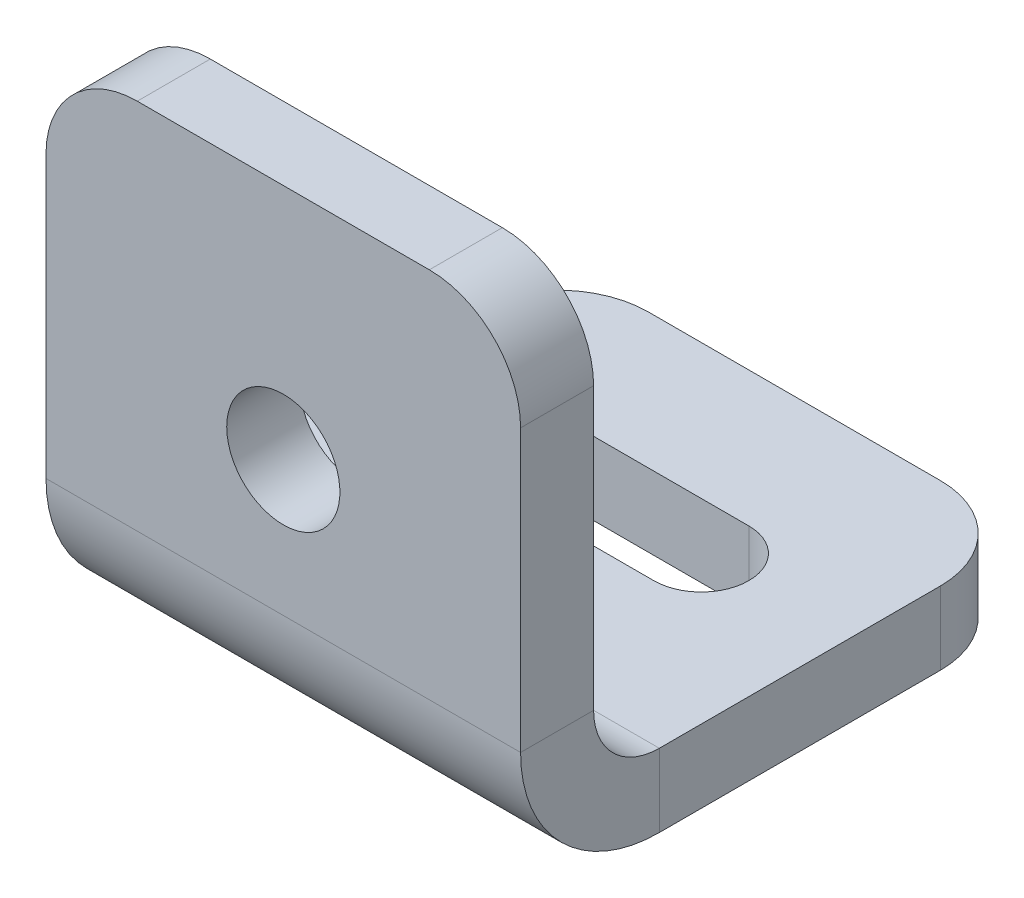
ISO-10303-21;
HEADER;
FILE_DESCRIPTION(('STEP AP214'),'2;1');
FILE_NAME('part.step','',(''),(''),'','','');
FILE_SCHEMA(('AUTOMOTIVE_DESIGN { 1 0 10303 214 1 1 1 1 }'));
ENDSEC;
DATA;
#1=APPLICATION_CONTEXT('core data for automotive mechanical design processes');
#2=APPLICATION_PROTOCOL_DEFINITION('international standard','automotive_design',2000,#1);
#3=PRODUCT_CONTEXT('',#1,'mechanical');
#4=PRODUCT('Part','Part','',(#3));
#5=PRODUCT_RELATED_PRODUCT_CATEGORY('part','',(#4));
#6=PRODUCT_DEFINITION_FORMATION('','',#4);
#7=PRODUCT_DEFINITION_CONTEXT('part definition',#1,'design');
#8=PRODUCT_DEFINITION('design','',#6,#7);
#9=PRODUCT_DEFINITION_SHAPE('','',#8);
#10=(LENGTH_UNIT() NAMED_UNIT(*) SI_UNIT(.MILLI.,.METRE.));
#11=(NAMED_UNIT(*) PLANE_ANGLE_UNIT() SI_UNIT($,.RADIAN.));
#12=(NAMED_UNIT(*) SI_UNIT($,.STERADIAN.) SOLID_ANGLE_UNIT());
#13=UNCERTAINTY_MEASURE_WITH_UNIT(LENGTH_MEASURE(1.E-05),#10,'distance_accuracy_value','');
#14=(GEOMETRIC_REPRESENTATION_CONTEXT(3) GLOBAL_UNCERTAINTY_ASSIGNED_CONTEXT((#13)) GLOBAL_UNIT_ASSIGNED_CONTEXT((#10,
#11,#12)) REPRESENTATION_CONTEXT('',''));
#15=CARTESIAN_POINT('',(0.,0.,0.));
#16=DIRECTION('',(0.,0.,1.));
#17=DIRECTION('',(1.,0.,0.));
#18=AXIS2_PLACEMENT_3D('',#15,#16,#17);
#19=CARTESIAN_POINT('',(26.,7.6,0.));
#20=DIRECTION('',(1.,0.,0.));
#21=DIRECTION('',(0.,0.,-1.));
#22=AXIS2_PLACEMENT_3D('',#19,#20,#21);
#23=PLANE('',#22);
#24=DIRECTION('',(0.,0.,-1.));
#25=VECTOR('',#24,1.);
#26=CARTESIAN_POINT('',(26.,7.6,0.));
#27=LINE('',#26,#25);
#28=CARTESIAN_POINT('',(26.,7.6,0.));
#29=VERTEX_POINT('',#28);
#30=CARTESIAN_POINT('',(26.,7.6,-4.));
#31=VERTEX_POINT('',#30);
#32=EDGE_CURVE('E309',#29,#31,#27,.T.);
#33=ORIENTED_EDGE('',*,*,#32,.F.);
#34=CARTESIAN_POINT('',(26.,7.6,-7.6));
#35=DIRECTION('',(-1.,0.,0.));
#36=DIRECTION('',(0.,0.,1.));
#37=AXIS2_PLACEMENT_3D('',#34,#35,#36);
#38=CIRCLE('',#37,7.6);
#39=CARTESIAN_POINT('',(26.,0.,-7.6));
#40=VERTEX_POINT('',#39);
#41=EDGE_CURVE('E245',#29,#40,#38,.F.);
#42=ORIENTED_EDGE('',*,*,#41,.T.);
#43=DIRECTION('',(0.,-1.,0.));
#44=VECTOR('',#43,1.);
#45=CARTESIAN_POINT('',(26.,4.,-7.6));
#46=LINE('',#45,#44);
#47=CARTESIAN_POINT('',(26.,4.,-7.6));
#48=VERTEX_POINT('',#47);
#49=EDGE_CURVE('E306',#48,#40,#46,.T.);
#50=ORIENTED_EDGE('',*,*,#49,.F.);
#51=CARTESIAN_POINT('',(26.,7.6,-7.6));
#52=DIRECTION('',(1.,0.,0.));
#53=DIRECTION('',(0.,0.,-1.));
#54=AXIS2_PLACEMENT_3D('',#51,#52,#53);
#55=CIRCLE('',#54,3.6);
#56=EDGE_CURVE('E235',#31,#48,#55,.T.);
#57=ORIENTED_EDGE('',*,*,#56,.F.);
#58=EDGE_LOOP('',(#33,#42,#50,#57));
#59=FACE_BOUND('',#58,.T.);
#60=ADVANCED_FACE('F46',(#59),#23,.T.);
#61=CARTESIAN_POINT('',(26.,4.,-7.6));
#62=DIRECTION('',(1.,0.,0.));
#63=DIRECTION('',(0.,0.,-1.));
#64=AXIS2_PLACEMENT_3D('',#61,#62,#63);
#65=PLANE('',#64);
#66=DIRECTION('',(0.,1.,0.));
#67=VECTOR('',#66,1.);
#68=CARTESIAN_POINT('',(26.,0.,-4.));
#69=LINE('',#68,#67);
#70=CARTESIAN_POINT('',(26.,23.,-4.));
#71=VERTEX_POINT('',#70);
#72=EDGE_CURVE('E239',#71,#31,#69,.F.);
#73=ORIENTED_EDGE('',*,*,#72,.F.);
#74=DIRECTION('',(0.,0.,-1.));
#75=VECTOR('',#74,1.);
#76=CARTESIAN_POINT('',(26.,23.,-7.6));
#77=LINE('',#76,#75);
#78=CARTESIAN_POINT('',(26.,23.,0.));
#79=VERTEX_POINT('',#78);
#80=EDGE_CURVE('E325',#71,#79,#77,.F.);
#81=ORIENTED_EDGE('',*,*,#80,.T.);
#82=DIRECTION('',(0.,-1.,0.));
#83=VECTOR('',#82,1.);
#84=CARTESIAN_POINT('',(26.,0.,0.));
#85=LINE('',#84,#83);
#86=EDGE_CURVE('E242',#79,#29,#85,.T.);
#87=ORIENTED_EDGE('',*,*,#86,.T.);
#88=ORIENTED_EDGE('',*,*,#32,.T.);
#89=EDGE_LOOP('',(#73,#81,#87,#88));
#90=FACE_BOUND('',#89,.T.);
#91=ADVANCED_FACE('F399',(#90),#65,.T.);
#92=CARTESIAN_POINT('',(0.,0.,-7.6));
#93=DIRECTION('',(-1.,0.,0.));
#94=DIRECTION('',(0.,0.,1.));
#95=AXIS2_PLACEMENT_3D('',#92,#93,#94);
#96=PLANE('',#95);
#97=DIRECTION('',(0.,1.,0.));
#98=VECTOR('',#97,1.);
#99=CARTESIAN_POINT('',(0.,0.,-7.6));
#100=LINE('',#99,#98);
#101=CARTESIAN_POINT('',(0.,0.,-7.6));
#102=VERTEX_POINT('',#101);
#103=CARTESIAN_POINT('',(0.,4.,-7.6));
#104=VERTEX_POINT('',#103);
#105=EDGE_CURVE('E303',#102,#104,#100,.T.);
#106=ORIENTED_EDGE('',*,*,#105,.F.);
#107=CARTESIAN_POINT('',(0.,7.6,-7.6));
#108=DIRECTION('',(-1.,0.,0.));
#109=DIRECTION('',(0.,0.,1.));
#110=AXIS2_PLACEMENT_3D('',#107,#108,#109);
#111=CIRCLE('',#110,7.6);
#112=CARTESIAN_POINT('',(0.,7.6,0.));
#113=VERTEX_POINT('',#112);
#114=EDGE_CURVE('E232',#113,#102,#111,.F.);
#115=ORIENTED_EDGE('',*,*,#114,.F.);
#116=DIRECTION('',(0.,0.,1.));
#117=VECTOR('',#116,1.);
#118=CARTESIAN_POINT('',(0.,7.6,-4.));
#119=LINE('',#118,#117);
#120=CARTESIAN_POINT('',(0.,7.6,-4.));
#121=VERTEX_POINT('',#120);
#122=EDGE_CURVE('E299',#121,#113,#119,.T.);
#123=ORIENTED_EDGE('',*,*,#122,.F.);
#124=CARTESIAN_POINT('',(0.,7.6,-7.6));
#125=DIRECTION('',(1.,0.,0.));
#126=DIRECTION('',(0.,0.,-1.));
#127=AXIS2_PLACEMENT_3D('',#124,#125,#126);
#128=CIRCLE('',#127,3.6);
#129=EDGE_CURVE('E257',#121,#104,#128,.T.);
#130=ORIENTED_EDGE('',*,*,#129,.T.);
#131=EDGE_LOOP('',(#106,#115,#123,#130));
#132=FACE_BOUND('',#131,.T.);
#133=ADVANCED_FACE('F387',(#132),#96,.T.);
#134=CARTESIAN_POINT('',(0.,7.6,-4.));
#135=DIRECTION('',(-1.,0.,0.));
#136=DIRECTION('',(0.,0.,1.));
#137=AXIS2_PLACEMENT_3D('',#134,#135,#136);
#138=PLANE('',#137);
#139=DIRECTION('',(0.,0.,-1.));
#140=VECTOR('',#139,1.);
#141=CARTESIAN_POINT('',(0.,4.,0.));
#142=LINE('',#141,#140);
#143=CARTESIAN_POINT('',(0.,4.,-23.));
#144=VERTEX_POINT('',#143);
#145=EDGE_CURVE('E253',#104,#144,#142,.T.);
#146=ORIENTED_EDGE('',*,*,#145,.T.);
#147=DIRECTION('',(0.,-1.,0.));
#148=VECTOR('',#147,1.);
#149=CARTESIAN_POINT('',(0.,7.6,-23.));
#150=LINE('',#149,#148);
#151=CARTESIAN_POINT('',(0.,0.,-23.));
#152=VERTEX_POINT('',#151);
#153=EDGE_CURVE('E338',#144,#152,#150,.T.);
#154=ORIENTED_EDGE('',*,*,#153,.T.);
#155=DIRECTION('',(0.,0.,-1.));
#156=VECTOR('',#155,1.);
#157=CARTESIAN_POINT('',(0.,0.,0.));
#158=LINE('',#157,#156);
#159=EDGE_CURVE('E224',#102,#152,#158,.T.);
#160=ORIENTED_EDGE('',*,*,#159,.F.);
#161=ORIENTED_EDGE('',*,*,#105,.T.);
#162=EDGE_LOOP('',(#146,#154,#160,#161));
#163=FACE_BOUND('',#162,.T.);
#164=ADVANCED_FACE('F366',(#163),#138,.T.);
#165=CARTESIAN_POINT('',(26.,0.,0.));
#166=DIRECTION('',(0.,1.,0.));
#167=DIRECTION('',(0.,0.,1.));
#168=AXIS2_PLACEMENT_3D('',#165,#166,#167);
#169=PLANE('',#168);
#170=DIRECTION('',(-1.,0.,0.));
#171=VECTOR('',#170,1.);
#172=CARTESIAN_POINT('',(8.1,0.,-20.6));
#173=LINE('',#172,#171);
#174=CARTESIAN_POINT('',(17.9,0.,-20.6));
#175=VERTEX_POINT('',#174);
#176=CARTESIAN_POINT('',(8.1,0.,-20.6));
#177=VERTEX_POINT('',#176);
#178=EDGE_CURVE('E175',#175,#177,#173,.T.);
#179=ORIENTED_EDGE('',*,*,#178,.T.);
#180=CARTESIAN_POINT('',(8.1,0.,-18.));
#181=DIRECTION('',(0.,1.,0.));
#182=DIRECTION('',(0.,0.,1.));
#183=AXIS2_PLACEMENT_3D('',#180,#181,#182);
#184=CIRCLE('',#183,2.6);
#185=CARTESIAN_POINT('',(8.1,0.,-15.4));
#186=VERTEX_POINT('',#185);
#187=EDGE_CURVE('E166',#177,#186,#184,.T.);
#188=ORIENTED_EDGE('',*,*,#187,.T.);
#189=DIRECTION('',(1.,0.,0.));
#190=VECTOR('',#189,1.);
#191=CARTESIAN_POINT('',(8.1,0.,-15.4));
#192=LINE('',#191,#190);
#193=CARTESIAN_POINT('',(17.9,0.,-15.4));
#194=VERTEX_POINT('',#193);
#195=EDGE_CURVE('E179',#186,#194,#192,.T.);
#196=ORIENTED_EDGE('',*,*,#195,.T.);
#197=CARTESIAN_POINT('',(17.9,0.,-18.));
#198=DIRECTION('',(0.,1.,0.));
#199=DIRECTION('',(0.,0.,1.));
#200=AXIS2_PLACEMENT_3D('',#197,#198,#199);
#201=CIRCLE('',#200,2.6);
#202=EDGE_CURVE('E184',#194,#175,#201,.T.);
#203=ORIENTED_EDGE('',*,*,#202,.T.);
#204=EDGE_LOOP('',(#179,#188,#196,#203));
#205=FACE_BOUND('',#204,.T.);
#206=ORIENTED_EDGE('',*,*,#159,.T.);
#207=CARTESIAN_POINT('',(5.,0.,-23.));
#208=DIRECTION('',(0.,1.,0.));
#209=DIRECTION('',(0.,0.,1.));
#210=AXIS2_PLACEMENT_3D('',#207,#208,#209);
#211=CIRCLE('',#210,5.);
#212=CARTESIAN_POINT('',(5.00000000000001,0.,-28.));
#213=VERTEX_POINT('',#212);
#214=EDGE_CURVE('E345',#152,#213,#211,.F.);
#215=ORIENTED_EDGE('',*,*,#214,.T.);
#216=DIRECTION('',(-1.,0.,0.));
#217=VECTOR('',#216,1.);
#218=CARTESIAN_POINT('',(26.,0.,-28.));
#219=LINE('',#218,#217);
#220=CARTESIAN_POINT('',(21.,0.,-28.));
#221=VERTEX_POINT('',#220);
#222=EDGE_CURVE('E296',#221,#213,#219,.T.);
#223=ORIENTED_EDGE('',*,*,#222,.F.);
#224=CARTESIAN_POINT('',(21.,0.,-23.));
#225=DIRECTION('',(0.,1.,0.));
#226=DIRECTION('',(0.,0.,1.));
#227=AXIS2_PLACEMENT_3D('',#224,#225,#226);
#228=CIRCLE('',#227,5.);
#229=CARTESIAN_POINT('',(26.,0.,-23.));
#230=VERTEX_POINT('',#229);
#231=EDGE_CURVE('E342',#221,#230,#228,.F.);
#232=ORIENTED_EDGE('',*,*,#231,.T.);
#233=DIRECTION('',(0.,0.,-1.));
#234=VECTOR('',#233,1.);
#235=CARTESIAN_POINT('',(26.,0.,0.));
#236=LINE('',#235,#234);
#237=EDGE_CURVE('E228',#40,#230,#236,.T.);
#238=ORIENTED_EDGE('',*,*,#237,.F.);
#239=DIRECTION('',(-1.,0.,0.));
#240=VECTOR('',#239,1.);
#241=CARTESIAN_POINT('',(26.,0.,-7.6));
#242=LINE('',#241,#240);
#243=EDGE_CURVE('E249',#40,#102,#242,.T.);
#244=ORIENTED_EDGE('',*,*,#243,.T.);
#245=EDGE_LOOP('',(#206,#215,#223,#232,#238,#244));
#246=FACE_BOUND('',#245,.T.);
#247=ADVANCED_FACE('F186',(#205,#246),#169,.F.);
#248=CARTESIAN_POINT('',(26.,4.,-28.));
#249=DIRECTION('',(0.,0.,-1.));
#250=DIRECTION('',(-1.,0.,0.));
#251=AXIS2_PLACEMENT_3D('',#248,#249,#250);
#252=PLANE('',#251);
#253=ORIENTED_EDGE('',*,*,#222,.T.);
#254=DIRECTION('',(0.,-1.,0.));
#255=VECTOR('',#254,1.);
#256=CARTESIAN_POINT('',(5.,4.,-28.));
#257=LINE('',#256,#255);
#258=CARTESIAN_POINT('',(5.00000000000001,4.,-28.));
#259=VERTEX_POINT('',#258);
#260=EDGE_CURVE('E68',#213,#259,#257,.F.);
#261=ORIENTED_EDGE('',*,*,#260,.T.);
#262=DIRECTION('',(-1.,0.,0.));
#263=VECTOR('',#262,1.);
#264=CARTESIAN_POINT('',(26.,4.,-28.));
#265=LINE('',#264,#263);
#266=CARTESIAN_POINT('',(21.,4.,-28.));
#267=VERTEX_POINT('',#266);
#268=EDGE_CURVE('E293',#267,#259,#265,.T.);
#269=ORIENTED_EDGE('',*,*,#268,.F.);
#270=DIRECTION('',(0.,-1.,0.));
#271=VECTOR('',#270,1.);
#272=CARTESIAN_POINT('',(21.,4.,-28.));
#273=LINE('',#272,#271);
#274=EDGE_CURVE('E348',#267,#221,#273,.T.);
#275=ORIENTED_EDGE('',*,*,#274,.T.);
#276=EDGE_LOOP('',(#253,#261,#269,#275));
#277=FACE_BOUND('',#276,.T.);
#278=ADVANCED_FACE('F370',(#277),#252,.T.);
#279=CARTESIAN_POINT('',(26.,4.,0.));
#280=DIRECTION('',(0.,1.,0.));
#281=DIRECTION('',(0.,0.,1.));
#282=AXIS2_PLACEMENT_3D('',#279,#280,#281);
#283=PLANE('',#282);
#284=CARTESIAN_POINT('',(8.1,4.,-18.));
#285=DIRECTION('',(0.,1.,0.));
#286=DIRECTION('',(0.,0.,1.));
#287=AXIS2_PLACEMENT_3D('',#284,#285,#286);
#288=CIRCLE('',#287,2.6);
#289=CARTESIAN_POINT('',(8.1,4.,-20.6));
#290=VERTEX_POINT('',#289);
#291=CARTESIAN_POINT('',(8.1,4.,-15.4));
#292=VERTEX_POINT('',#291);
#293=EDGE_CURVE('E169',#290,#292,#288,.T.);
#294=ORIENTED_EDGE('',*,*,#293,.F.);
#295=DIRECTION('',(-1.,0.,0.));
#296=VECTOR('',#295,1.);
#297=CARTESIAN_POINT('',(8.1,4.,-20.6));
#298=LINE('',#297,#296);
#299=CARTESIAN_POINT('',(17.9,4.,-20.6));
#300=VERTEX_POINT('',#299);
#301=EDGE_CURVE('E190',#300,#290,#298,.T.);
#302=ORIENTED_EDGE('',*,*,#301,.F.);
#303=CARTESIAN_POINT('',(17.9,4.,-18.));
#304=DIRECTION('',(0.,1.,0.));
#305=DIRECTION('',(0.,0.,1.));
#306=AXIS2_PLACEMENT_3D('',#303,#304,#305);
#307=CIRCLE('',#306,2.6);
#308=CARTESIAN_POINT('',(17.9,4.,-15.4));
#309=VERTEX_POINT('',#308);
#310=EDGE_CURVE('E196',#309,#300,#307,.T.);
#311=ORIENTED_EDGE('',*,*,#310,.F.);
#312=DIRECTION('',(1.,0.,0.));
#313=VECTOR('',#312,1.);
#314=CARTESIAN_POINT('',(8.1,4.,-15.4));
#315=LINE('',#314,#313);
#316=EDGE_CURVE('E205',#292,#309,#315,.T.);
#317=ORIENTED_EDGE('',*,*,#316,.F.);
#318=EDGE_LOOP('',(#294,#302,#311,#317));
#319=FACE_BOUND('',#318,.T.);
#320=ORIENTED_EDGE('',*,*,#268,.T.);
#321=CARTESIAN_POINT('',(5.,4.,-23.));
#322=DIRECTION('',(0.,1.,0.));
#323=DIRECTION('',(0.,0.,1.));
#324=AXIS2_PLACEMENT_3D('',#321,#322,#323);
#325=CIRCLE('',#324,5.);
#326=EDGE_CURVE('E55',#259,#144,#325,.T.);
#327=ORIENTED_EDGE('',*,*,#326,.T.);
#328=ORIENTED_EDGE('',*,*,#145,.F.);
#329=DIRECTION('',(-1.,0.,0.));
#330=VECTOR('',#329,1.);
#331=CARTESIAN_POINT('',(26.,4.,-7.6));
#332=LINE('',#331,#330);
#333=EDGE_CURVE('E289',#48,#104,#332,.T.);
#334=ORIENTED_EDGE('',*,*,#333,.F.);
#335=DIRECTION('',(0.,0.,-1.));
#336=VECTOR('',#335,1.);
#337=CARTESIAN_POINT('',(26.,4.,0.));
#338=LINE('',#337,#336);
#339=CARTESIAN_POINT('',(26.,4.,-23.));
#340=VERTEX_POINT('',#339);
#341=EDGE_CURVE('E231',#48,#340,#338,.T.);
#342=ORIENTED_EDGE('',*,*,#341,.T.);
#343=CARTESIAN_POINT('',(21.,4.,-23.));
#344=DIRECTION('',(0.,1.,0.));
#345=DIRECTION('',(0.,0.,1.));
#346=AXIS2_PLACEMENT_3D('',#343,#344,#345);
#347=CIRCLE('',#346,5.);
#348=EDGE_CURVE('E354',#340,#267,#347,.T.);
#349=ORIENTED_EDGE('',*,*,#348,.T.);
#350=EDGE_LOOP('',(#320,#327,#328,#334,#342,#349));
#351=FACE_BOUND('',#350,.T.);
#352=ADVANCED_FACE('F361',(#319,#351),#283,.T.);
#353=CARTESIAN_POINT('',(26.,7.6,-7.6));
#354=DIRECTION('',(-1.,0.,0.));
#355=DIRECTION('',(0.,0.,1.));
#356=AXIS2_PLACEMENT_3D('',#353,#354,#355);
#357=CYLINDRICAL_SURFACE('',#356,3.6);
#358=ORIENTED_EDGE('',*,*,#129,.F.);
#359=DIRECTION('',(-1.,0.,0.));
#360=VECTOR('',#359,1.);
#361=CARTESIAN_POINT('',(26.,7.6,-4.));
#362=LINE('',#361,#360);
#363=EDGE_CURVE('E285',#31,#121,#362,.T.);
#364=ORIENTED_EDGE('',*,*,#363,.F.);
#365=ORIENTED_EDGE('',*,*,#56,.T.);
#366=ORIENTED_EDGE('',*,*,#333,.T.);
#367=EDGE_LOOP('',(#358,#364,#365,#366));
#368=FACE_BOUND('',#367,.T.);
#369=ADVANCED_FACE('F391',(#368),#357,.F.);
#370=CARTESIAN_POINT('',(26.,0.,-4.));
#371=DIRECTION('',(0.,0.,-1.));
#372=DIRECTION('',(-1.,0.,0.));
#373=AXIS2_PLACEMENT_3D('',#370,#371,#372);
#374=PLANE('',#373);
#375=CARTESIAN_POINT('',(13.,15.,-4.));
#376=DIRECTION('',(0.,0.,-1.));
#377=DIRECTION('',(-1.,0.,0.));
#378=AXIS2_PLACEMENT_3D('',#375,#376,#377);
#379=CIRCLE('',#378,3.1);
#380=CARTESIAN_POINT('',(9.9,15.,-4.));
#381=VERTEX_POINT('',#380);
#382=EDGE_CURVE('E214',#381,#381,#379,.T.);
#383=ORIENTED_EDGE('',*,*,#382,.F.);
#384=EDGE_LOOP('',(#383));
#385=FACE_BOUND('',#384,.T.);
#386=DIRECTION('',(-1.,0.,0.));
#387=VECTOR('',#386,1.);
#388=CARTESIAN_POINT('',(26.,28.,-4.));
#389=LINE('',#388,#387);
#390=CARTESIAN_POINT('',(21.,28.,-4.));
#391=VERTEX_POINT('',#390);
#392=CARTESIAN_POINT('',(5.00000000000001,28.,-4.));
#393=VERTEX_POINT('',#392);
#394=EDGE_CURVE('E281',#391,#393,#389,.T.);
#395=ORIENTED_EDGE('',*,*,#394,.F.);
#396=CARTESIAN_POINT('',(21.,23.,-4.));
#397=DIRECTION('',(0.,0.,-1.));
#398=DIRECTION('',(-1.,0.,0.));
#399=AXIS2_PLACEMENT_3D('',#396,#397,#398);
#400=CIRCLE('',#399,5.);
#401=EDGE_CURVE('E322',#391,#71,#400,.T.);
#402=ORIENTED_EDGE('',*,*,#401,.T.);
#403=ORIENTED_EDGE('',*,*,#72,.T.);
#404=ORIENTED_EDGE('',*,*,#363,.T.);
#405=DIRECTION('',(0.,1.,0.));
#406=VECTOR('',#405,1.);
#407=CARTESIAN_POINT('',(0.,0.,-4.));
#408=LINE('',#407,#406);
#409=CARTESIAN_POINT('',(0.,23.,-4.));
#410=VERTEX_POINT('',#409);
#411=EDGE_CURVE('E261',#410,#121,#408,.F.);
#412=ORIENTED_EDGE('',*,*,#411,.F.);
#413=CARTESIAN_POINT('',(5.,23.,-4.));
#414=DIRECTION('',(0.,0.,-1.));
#415=DIRECTION('',(-1.,0.,0.));
#416=AXIS2_PLACEMENT_3D('',#413,#414,#415);
#417=CIRCLE('',#416,5.);
#418=EDGE_CURVE('E319',#410,#393,#417,.T.);
#419=ORIENTED_EDGE('',*,*,#418,.T.);
#420=EDGE_LOOP('',(#395,#402,#403,#404,#412,#419));
#421=FACE_BOUND('',#420,.T.);
#422=ADVANCED_FACE('F395',(#385,#421),#374,.T.);
#423=CARTESIAN_POINT('',(26.,28.,0.));
#424=DIRECTION('',(0.,1.,0.));
#425=DIRECTION('',(0.,0.,1.));
#426=AXIS2_PLACEMENT_3D('',#423,#424,#425);
#427=PLANE('',#426);
#428=DIRECTION('',(-1.,0.,0.));
#429=VECTOR('',#428,1.);
#430=CARTESIAN_POINT('',(26.,28.,0.));
#431=LINE('',#430,#429);
#432=CARTESIAN_POINT('',(21.,28.,0.));
#433=VERTEX_POINT('',#432);
#434=CARTESIAN_POINT('',(5.00000000000001,28.,0.));
#435=VERTEX_POINT('',#434);
#436=EDGE_CURVE('E277',#433,#435,#431,.T.);
#437=ORIENTED_EDGE('',*,*,#436,.F.);
#438=DIRECTION('',(0.,0.,-1.));
#439=VECTOR('',#438,1.);
#440=CARTESIAN_POINT('',(21.,28.,0.));
#441=LINE('',#440,#439);
#442=EDGE_CURVE('E315',#433,#391,#441,.T.);
#443=ORIENTED_EDGE('',*,*,#442,.T.);
#444=ORIENTED_EDGE('',*,*,#394,.T.);
#445=DIRECTION('',(0.,0.,-1.));
#446=VECTOR('',#445,1.);
#447=CARTESIAN_POINT('',(5.,28.,0.));
#448=LINE('',#447,#446);
#449=EDGE_CURVE('E313',#393,#435,#448,.F.);
#450=ORIENTED_EDGE('',*,*,#449,.T.);
#451=EDGE_LOOP('',(#437,#443,#444,#450));
#452=FACE_BOUND('',#451,.T.);
#453=ADVANCED_FACE('F409',(#452),#427,.T.);
#454=CARTESIAN_POINT('',(26.,0.,0.));
#455=DIRECTION('',(0.,0.,-1.));
#456=DIRECTION('',(-1.,0.,0.));
#457=AXIS2_PLACEMENT_3D('',#454,#455,#456);
#458=PLANE('',#457);
#459=CARTESIAN_POINT('',(13.,15.,0.));
#460=DIRECTION('',(0.,0.,-1.));
#461=DIRECTION('',(-1.,0.,0.));
#462=AXIS2_PLACEMENT_3D('',#459,#460,#461);
#463=CIRCLE('',#462,3.1);
#464=CARTESIAN_POINT('',(9.9,15.,0.));
#465=VERTEX_POINT('',#464);
#466=EDGE_CURVE('E220',#465,#465,#463,.T.);
#467=ORIENTED_EDGE('',*,*,#466,.T.);
#468=EDGE_LOOP('',(#467));
#469=FACE_BOUND('',#468,.T.);
#470=ORIENTED_EDGE('',*,*,#86,.F.);
#471=CARTESIAN_POINT('',(21.,23.,0.));
#472=DIRECTION('',(0.,0.,-1.));
#473=DIRECTION('',(-1.,0.,0.));
#474=AXIS2_PLACEMENT_3D('',#471,#472,#473);
#475=CIRCLE('',#474,5.);
#476=EDGE_CURVE('E331',#79,#433,#475,.F.);
#477=ORIENTED_EDGE('',*,*,#476,.T.);
#478=ORIENTED_EDGE('',*,*,#436,.T.);
#479=CARTESIAN_POINT('',(5.,23.,0.));
#480=DIRECTION('',(0.,0.,-1.));
#481=DIRECTION('',(-1.,0.,0.));
#482=AXIS2_PLACEMENT_3D('',#479,#480,#481);
#483=CIRCLE('',#482,5.);
#484=CARTESIAN_POINT('',(0.,23.,0.));
#485=VERTEX_POINT('',#484);
#486=EDGE_CURVE('E328',#435,#485,#483,.F.);
#487=ORIENTED_EDGE('',*,*,#486,.T.);
#488=DIRECTION('',(0.,-1.,0.));
#489=VECTOR('',#488,1.);
#490=CARTESIAN_POINT('',(0.,0.,0.));
#491=LINE('',#490,#489);
#492=EDGE_CURVE('E264',#485,#113,#491,.T.);
#493=ORIENTED_EDGE('',*,*,#492,.T.);
#494=DIRECTION('',(-1.,0.,0.));
#495=VECTOR('',#494,1.);
#496=CARTESIAN_POINT('',(26.,7.6,0.));
#497=LINE('',#496,#495);
#498=EDGE_CURVE('E273',#29,#113,#497,.T.);
#499=ORIENTED_EDGE('',*,*,#498,.F.);
#500=EDGE_LOOP('',(#470,#477,#478,#487,#493,#499));
#501=FACE_BOUND('',#500,.T.);
#502=ADVANCED_FACE('F403',(#469,#501),#458,.F.);
#503=CARTESIAN_POINT('',(26.,7.6,-7.6));
#504=DIRECTION('',(-1.,0.,0.));
#505=DIRECTION('',(0.,0.,1.));
#506=AXIS2_PLACEMENT_3D('',#503,#504,#505);
#507=CYLINDRICAL_SURFACE('',#506,7.6);
#508=ORIENTED_EDGE('',*,*,#114,.T.);
#509=ORIENTED_EDGE('',*,*,#243,.F.);
#510=ORIENTED_EDGE('',*,*,#41,.F.);
#511=ORIENTED_EDGE('',*,*,#498,.T.);
#512=EDGE_LOOP('',(#508,#509,#510,#511));
#513=FACE_BOUND('',#512,.T.);
#514=ADVANCED_FACE('F383',(#513),#507,.T.);
#515=CARTESIAN_POINT('',(26.,7.6,-7.6));
#516=DIRECTION('',(1.,0.,0.));
#517=DIRECTION('',(0.,0.,-1.));
#518=AXIS2_PLACEMENT_3D('',#515,#516,#517);
#519=PLANE('',#518);
#520=ORIENTED_EDGE('',*,*,#237,.T.);
#521=DIRECTION('',(0.,-1.,0.));
#522=VECTOR('',#521,1.);
#523=CARTESIAN_POINT('',(26.,7.6,-23.));
#524=LINE('',#523,#522);
#525=EDGE_CURVE('E11',#230,#340,#524,.F.);
#526=ORIENTED_EDGE('',*,*,#525,.T.);
#527=ORIENTED_EDGE('',*,*,#341,.F.);
#528=ORIENTED_EDGE('',*,*,#49,.T.);
#529=EDGE_LOOP('',(#520,#526,#527,#528));
#530=FACE_BOUND('',#529,.T.);
#531=ADVANCED_FACE('F375',(#530),#519,.T.);
#532=CARTESIAN_POINT('',(0.,7.6,-7.6));
#533=DIRECTION('',(1.,0.,0.));
#534=DIRECTION('',(0.,0.,-1.));
#535=AXIS2_PLACEMENT_3D('',#532,#533,#534);
#536=PLANE('',#535);
#537=ORIENTED_EDGE('',*,*,#492,.F.);
#538=DIRECTION('',(0.,0.,-1.));
#539=VECTOR('',#538,1.);
#540=CARTESIAN_POINT('',(0.,23.,-4.));
#541=LINE('',#540,#539);
#542=EDGE_CURVE('E334',#485,#410,#541,.T.);
#543=ORIENTED_EDGE('',*,*,#542,.T.);
#544=ORIENTED_EDGE('',*,*,#411,.T.);
#545=ORIENTED_EDGE('',*,*,#122,.T.);
#546=EDGE_LOOP('',(#537,#543,#544,#545));
#547=FACE_BOUND('',#546,.T.);
#548=ADVANCED_FACE('F417',(#547),#536,.F.);
#549=CARTESIAN_POINT('',(13.,15.,0.));
#550=DIRECTION('',(0.,0.,-1.));
#551=DIRECTION('',(-1.,0.,0.));
#552=AXIS2_PLACEMENT_3D('',#549,#550,#551);
#553=CYLINDRICAL_SURFACE('',#552,3.1);
#554=ORIENTED_EDGE('',*,*,#466,.F.);
#555=EDGE_LOOP('',(#554));
#556=FACE_BOUND('',#555,.T.);
#557=ORIENTED_EDGE('',*,*,#382,.T.);
#558=EDGE_LOOP('',(#557));
#559=FACE_BOUND('',#558,.T.);
#560=ADVANCED_FACE('F419',(#556,#559),#553,.F.);
#561=CARTESIAN_POINT('',(8.1,0.,-18.));
#562=DIRECTION('',(0.,1.,0.));
#563=DIRECTION('',(0.,0.,1.));
#564=AXIS2_PLACEMENT_3D('',#561,#562,#563);
#565=CYLINDRICAL_SURFACE('',#564,2.6);
#566=ORIENTED_EDGE('',*,*,#293,.T.);
#567=DIRECTION('',(0.,1.,0.));
#568=VECTOR('',#567,1.);
#569=CARTESIAN_POINT('',(8.1,0.,-15.4));
#570=LINE('',#569,#568);
#571=EDGE_CURVE('E162',#186,#292,#570,.T.);
#572=ORIENTED_EDGE('',*,*,#571,.F.);
#573=ORIENTED_EDGE('',*,*,#187,.F.);
#574=DIRECTION('',(0.,1.,0.));
#575=VECTOR('',#574,1.);
#576=CARTESIAN_POINT('',(8.1,0.,-20.6));
#577=LINE('',#576,#575);
#578=EDGE_CURVE('E211',#177,#290,#577,.T.);
#579=ORIENTED_EDGE('',*,*,#578,.T.);
#580=EDGE_LOOP('',(#566,#572,#573,#579));
#581=FACE_BOUND('',#580,.T.);
#582=ADVANCED_FACE('F164',(#581),#565,.F.);
#583=CARTESIAN_POINT('',(8.1,0.,-20.6));
#584=DIRECTION('',(0.,0.,-1.));
#585=DIRECTION('',(-1.,0.,0.));
#586=AXIS2_PLACEMENT_3D('',#583,#584,#585);
#587=PLANE('',#586);
#588=ORIENTED_EDGE('',*,*,#301,.T.);
#589=ORIENTED_EDGE('',*,*,#578,.F.);
#590=ORIENTED_EDGE('',*,*,#178,.F.);
#591=DIRECTION('',(0.,1.,0.));
#592=VECTOR('',#591,1.);
#593=CARTESIAN_POINT('',(17.9,0.,-20.6));
#594=LINE('',#593,#592);
#595=EDGE_CURVE('E215',#175,#300,#594,.T.);
#596=ORIENTED_EDGE('',*,*,#595,.T.);
#597=EDGE_LOOP('',(#588,#589,#590,#596));
#598=FACE_BOUND('',#597,.T.);
#599=ADVANCED_FACE('F474',(#598),#587,.F.);
#600=CARTESIAN_POINT('',(17.9,0.,-18.));
#601=DIRECTION('',(0.,1.,0.));
#602=DIRECTION('',(0.,0.,1.));
#603=AXIS2_PLACEMENT_3D('',#600,#601,#602);
#604=CYLINDRICAL_SURFACE('',#603,2.6);
#605=ORIENTED_EDGE('',*,*,#310,.T.);
#606=ORIENTED_EDGE('',*,*,#595,.F.);
#607=ORIENTED_EDGE('',*,*,#202,.F.);
#608=DIRECTION('',(0.,1.,0.));
#609=VECTOR('',#608,1.);
#610=CARTESIAN_POINT('',(17.9,0.,-15.4));
#611=LINE('',#610,#609);
#612=EDGE_CURVE('E174',#194,#309,#611,.T.);
#613=ORIENTED_EDGE('',*,*,#612,.T.);
#614=EDGE_LOOP('',(#605,#606,#607,#613));
#615=FACE_BOUND('',#614,.T.);
#616=ADVANCED_FACE('F466',(#615),#604,.F.);
#617=CARTESIAN_POINT('',(8.1,0.,-15.4));
#618=DIRECTION('',(0.,0.,1.));
#619=DIRECTION('',(1.,0.,0.));
#620=AXIS2_PLACEMENT_3D('',#617,#618,#619);
#621=PLANE('',#620);
#622=ORIENTED_EDGE('',*,*,#316,.T.);
#623=ORIENTED_EDGE('',*,*,#612,.F.);
#624=ORIENTED_EDGE('',*,*,#195,.F.);
#625=ORIENTED_EDGE('',*,*,#571,.T.);
#626=EDGE_LOOP('',(#622,#623,#624,#625));
#627=FACE_BOUND('',#626,.T.);
#628=ADVANCED_FACE('F180',(#627),#621,.F.);
#629=CARTESIAN_POINT('',(21.,23.,0.));
#630=DIRECTION('',(0.,0.,-1.));
#631=DIRECTION('',(-1.,0.,0.));
#632=AXIS2_PLACEMENT_3D('',#629,#630,#631);
#633=CYLINDRICAL_SURFACE('',#632,5.);
#634=ORIENTED_EDGE('',*,*,#476,.F.);
#635=ORIENTED_EDGE('',*,*,#80,.F.);
#636=ORIENTED_EDGE('',*,*,#401,.F.);
#637=ORIENTED_EDGE('',*,*,#442,.F.);
#638=EDGE_LOOP('',(#634,#635,#636,#637));
#639=FACE_BOUND('',#638,.T.);
#640=ADVANCED_FACE('F407',(#639),#633,.T.);
#641=CARTESIAN_POINT('',(5.,23.,-7.6));
#642=DIRECTION('',(0.,0.,1.));
#643=DIRECTION('',(1.,0.,0.));
#644=AXIS2_PLACEMENT_3D('',#641,#642,#643);
#645=CYLINDRICAL_SURFACE('',#644,5.);
#646=ORIENTED_EDGE('',*,*,#486,.F.);
#647=ORIENTED_EDGE('',*,*,#449,.F.);
#648=ORIENTED_EDGE('',*,*,#418,.F.);
#649=ORIENTED_EDGE('',*,*,#542,.F.);
#650=EDGE_LOOP('',(#646,#647,#648,#649));
#651=FACE_BOUND('',#650,.T.);
#652=ADVANCED_FACE('F414',(#651),#645,.T.);
#653=CARTESIAN_POINT('',(5.,7.6,-23.));
#654=DIRECTION('',(0.,-1.,0.));
#655=DIRECTION('',(0.,0.,-1.));
#656=AXIS2_PLACEMENT_3D('',#653,#654,#655);
#657=CYLINDRICAL_SURFACE('',#656,5.);
#658=ORIENTED_EDGE('',*,*,#326,.F.);
#659=ORIENTED_EDGE('',*,*,#260,.F.);
#660=ORIENTED_EDGE('',*,*,#214,.F.);
#661=ORIENTED_EDGE('',*,*,#153,.F.);
#662=EDGE_LOOP('',(#658,#659,#660,#661));
#663=FACE_BOUND('',#662,.T.);
#664=ADVANCED_FACE('F368',(#663),#657,.T.);
#665=CARTESIAN_POINT('',(21.,4.,-23.));
#666=DIRECTION('',(0.,-1.,0.));
#667=DIRECTION('',(0.,0.,-1.));
#668=AXIS2_PLACEMENT_3D('',#665,#666,#667);
#669=CYLINDRICAL_SURFACE('',#668,5.);
#670=ORIENTED_EDGE('',*,*,#348,.F.);
#671=ORIENTED_EDGE('',*,*,#525,.F.);
#672=ORIENTED_EDGE('',*,*,#231,.F.);
#673=ORIENTED_EDGE('',*,*,#274,.F.);
#674=EDGE_LOOP('',(#670,#671,#672,#673));
#675=FACE_BOUND('',#674,.T.);
#676=ADVANCED_FACE('F48',(#675),#669,.T.);
#677=CLOSED_SHELL('',(#60,#91,#133,#164,#247,#278,#352,#369,#422,#453,#502,#514,#531,#548,#560,
#582,#599,#616,#628,#640,#652,#664,#676));
#678=MANIFOLD_SOLID_BREP('B2',#677);
#679=ADVANCED_BREP_SHAPE_REPRESENTATION('',(#18,#678),#14);
#680=SHAPE_DEFINITION_REPRESENTATION(#9,#679);
ENDSEC;
END-ISO-10303-21;
